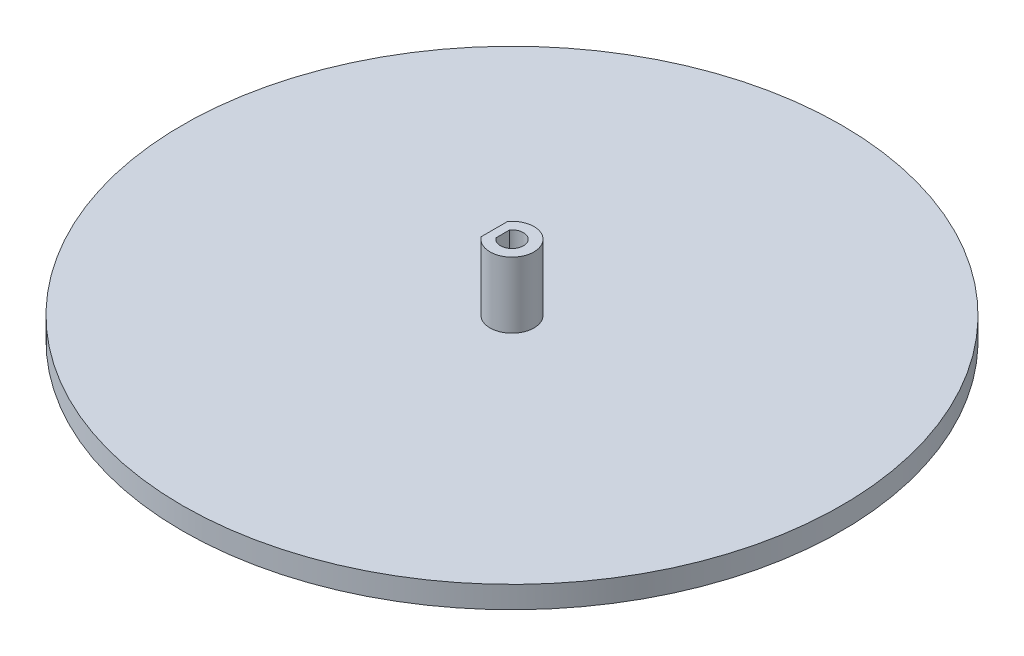
ISO-10303-21;
HEADER;
FILE_DESCRIPTION(('STEP AP214'),'2;1');
FILE_NAME('part.step','',(''),(''),'','','');
FILE_SCHEMA(('AUTOMOTIVE_DESIGN { 1 0 10303 214 1 1 1 1 }'));
ENDSEC;
DATA;
#1=APPLICATION_CONTEXT('core data for automotive mechanical design processes');
#2=APPLICATION_PROTOCOL_DEFINITION('international standard','automotive_design',2000,#1);
#3=PRODUCT_CONTEXT('',#1,'mechanical');
#4=PRODUCT('Part','Part','',(#3));
#5=PRODUCT_RELATED_PRODUCT_CATEGORY('part','',(#4));
#6=PRODUCT_DEFINITION_FORMATION('','',#4);
#7=PRODUCT_DEFINITION_CONTEXT('part definition',#1,'design');
#8=PRODUCT_DEFINITION('design','',#6,#7);
#9=PRODUCT_DEFINITION_SHAPE('','',#8);
#10=(LENGTH_UNIT() NAMED_UNIT(*) SI_UNIT(.MILLI.,.METRE.));
#11=(NAMED_UNIT(*) PLANE_ANGLE_UNIT() SI_UNIT($,.RADIAN.));
#12=(NAMED_UNIT(*) SI_UNIT($,.STERADIAN.) SOLID_ANGLE_UNIT());
#13=UNCERTAINTY_MEASURE_WITH_UNIT(LENGTH_MEASURE(1.E-05),#10,'distance_accuracy_value','');
#14=(GEOMETRIC_REPRESENTATION_CONTEXT(3) GLOBAL_UNCERTAINTY_ASSIGNED_CONTEXT((#13)) GLOBAL_UNIT_ASSIGNED_CONTEXT((#10,
#11,#12)) REPRESENTATION_CONTEXT('',''));
#15=CARTESIAN_POINT('',(0.,0.,0.));
#16=DIRECTION('',(0.,0.,1.));
#17=DIRECTION('',(1.,0.,0.));
#18=AXIS2_PLACEMENT_3D('',#15,#16,#17);
#19=CARTESIAN_POINT('',(0.,5.,0.));
#20=DIRECTION('',(0.,1.,0.));
#21=DIRECTION('',(0.,0.,1.));
#22=AXIS2_PLACEMENT_3D('',#19,#20,#21);
#23=PLANE('',#22);
#24=CARTESIAN_POINT('',(0.,5.,0.));
#25=DIRECTION('',(0.,1.,0.));
#26=DIRECTION('',(0.,0.,1.));
#27=AXIS2_PLACEMENT_3D('',#24,#25,#26);
#28=CIRCLE('',#27,75.);
#29=CARTESIAN_POINT('',(0.,5.,75.));
#30=VERTEX_POINT('',#29);
#31=EDGE_CURVE('E11',#30,#30,#28,.T.);
#32=ORIENTED_EDGE('',*,*,#31,.T.);
#33=EDGE_LOOP('',(#32));
#34=FACE_BOUND('',#33,.T.);
#35=DIRECTION('',(0.,0.,1.));
#36=VECTOR('',#35,1.);
#37=CARTESIAN_POINT('',(-4.,5.,-3.));
#38=LINE('',#37,#36);
#39=CARTESIAN_POINT('',(-4.,5.,-3.));
#40=VERTEX_POINT('',#39);
#41=CARTESIAN_POINT('',(-4.,5.,3.));
#42=VERTEX_POINT('',#41);
#43=EDGE_CURVE('E115',#40,#42,#38,.T.);
#44=ORIENTED_EDGE('',*,*,#43,.F.);
#45=CARTESIAN_POINT('',(0.,5.,0.));
#46=DIRECTION('',(0.,1.,0.));
#47=DIRECTION('',(0.,0.,1.));
#48=AXIS2_PLACEMENT_3D('',#45,#46,#47);
#49=CIRCLE('',#48,5.);
#50=EDGE_CURVE('E55',#42,#40,#49,.T.);
#51=ORIENTED_EDGE('',*,*,#50,.F.);
#52=EDGE_LOOP('',(#44,#51));
#53=FACE_BOUND('',#52,.T.);
#54=ADVANCED_FACE('F39',(#34,#53),#23,.T.);
#55=CARTESIAN_POINT('',(0.,5.,0.));
#56=DIRECTION('',(0.,-1.,0.));
#57=DIRECTION('',(0.,0.,-1.));
#58=AXIS2_PLACEMENT_3D('',#55,#56,#57);
#59=CYLINDRICAL_SURFACE('',#58,75.);
#60=ORIENTED_EDGE('',*,*,#31,.F.);
#61=EDGE_LOOP('',(#60));
#62=FACE_BOUND('',#61,.T.);
#63=CARTESIAN_POINT('',(0.,0.,0.));
#64=DIRECTION('',(0.,1.,0.));
#65=DIRECTION('',(0.,0.,1.));
#66=AXIS2_PLACEMENT_3D('',#63,#64,#65);
#67=CIRCLE('',#66,75.);
#68=CARTESIAN_POINT('',(0.,0.,75.));
#69=VERTEX_POINT('',#68);
#70=EDGE_CURVE('E43',#69,#69,#67,.T.);
#71=ORIENTED_EDGE('',*,*,#70,.T.);
#72=EDGE_LOOP('',(#71));
#73=FACE_BOUND('',#72,.T.);
#74=ADVANCED_FACE('F41',(#62,#73),#59,.T.);
#75=CARTESIAN_POINT('',(0.,0.,0.));
#76=DIRECTION('',(0.,1.,0.));
#77=DIRECTION('',(0.,0.,1.));
#78=AXIS2_PLACEMENT_3D('',#75,#76,#77);
#79=PLANE('',#78);
#80=ORIENTED_EDGE('',*,*,#70,.F.);
#81=EDGE_LOOP('',(#80));
#82=FACE_BOUND('',#81,.T.);
#83=ADVANCED_FACE('F134',(#82),#79,.F.);
#84=CARTESIAN_POINT('',(0.,20.,0.));
#85=DIRECTION('',(0.,1.,0.));
#86=DIRECTION('',(0.,0.,1.));
#87=AXIS2_PLACEMENT_3D('',#84,#85,#86);
#88=PLANE('',#87);
#89=CARTESIAN_POINT('',(0.,20.,0.));
#90=DIRECTION('',(0.,1.,0.));
#91=DIRECTION('',(0.,0.,1.));
#92=AXIS2_PLACEMENT_3D('',#89,#90,#91);
#93=CIRCLE('',#92,5.);
#94=CARTESIAN_POINT('',(-4.,20.,3.));
#95=VERTEX_POINT('',#94);
#96=CARTESIAN_POINT('',(-4.,20.,-3.));
#97=VERTEX_POINT('',#96);
#98=EDGE_CURVE('E110',#95,#97,#93,.T.);
#99=ORIENTED_EDGE('',*,*,#98,.T.);
#100=DIRECTION('',(0.,0.,1.));
#101=VECTOR('',#100,1.);
#102=CARTESIAN_POINT('',(-4.,20.,-3.));
#103=LINE('',#102,#101);
#104=EDGE_CURVE('E114',#97,#95,#103,.T.);
#105=ORIENTED_EDGE('',*,*,#104,.T.);
#106=EDGE_LOOP('',(#99,#105));
#107=FACE_BOUND('',#106,.T.);
#108=DIRECTION('',(0.,0.,1.));
#109=VECTOR('',#108,1.);
#110=CARTESIAN_POINT('',(-2.1,20.,-1.53297097167559));
#111=LINE('',#110,#109);
#112=CARTESIAN_POINT('',(-2.1,20.,-1.53297097167559));
#113=VERTEX_POINT('',#112);
#114=CARTESIAN_POINT('',(-2.1,20.,1.53297097167559));
#115=VERTEX_POINT('',#114);
#116=EDGE_CURVE('E83',#113,#115,#111,.T.);
#117=ORIENTED_EDGE('',*,*,#116,.F.);
#118=CARTESIAN_POINT('',(0.,20.,0.));
#119=DIRECTION('',(0.,1.,0.));
#120=DIRECTION('',(0.,0.,1.));
#121=AXIS2_PLACEMENT_3D('',#118,#119,#120);
#122=CIRCLE('',#121,2.6);
#123=EDGE_CURVE('E93',#115,#113,#122,.T.);
#124=ORIENTED_EDGE('',*,*,#123,.F.);
#125=EDGE_LOOP('',(#117,#124));
#126=FACE_BOUND('',#125,.T.);
#127=ADVANCED_FACE('F100',(#107,#126),#88,.T.);
#128=CARTESIAN_POINT('',(0.,20.,0.));
#129=DIRECTION('',(0.,-1.,0.));
#130=DIRECTION('',(0.,0.,-1.));
#131=AXIS2_PLACEMENT_3D('',#128,#129,#130);
#132=CYLINDRICAL_SURFACE('',#131,5.);
#133=ORIENTED_EDGE('',*,*,#50,.T.);
#134=DIRECTION('',(0.,-1.,0.));
#135=VECTOR('',#134,1.);
#136=CARTESIAN_POINT('',(-4.,20.,-3.));
#137=LINE('',#136,#135);
#138=EDGE_CURVE('E125',#97,#40,#137,.T.);
#139=ORIENTED_EDGE('',*,*,#138,.F.);
#140=ORIENTED_EDGE('',*,*,#98,.F.);
#141=DIRECTION('',(0.,-1.,0.));
#142=VECTOR('',#141,1.);
#143=CARTESIAN_POINT('',(-4.,20.,3.));
#144=LINE('',#143,#142);
#145=EDGE_CURVE('E118',#95,#42,#144,.T.);
#146=ORIENTED_EDGE('',*,*,#145,.T.);
#147=EDGE_LOOP('',(#133,#139,#140,#146));
#148=FACE_BOUND('',#147,.T.);
#149=ADVANCED_FACE('F141',(#148),#132,.T.);
#150=CARTESIAN_POINT('',(-4.,20.,-3.));
#151=DIRECTION('',(1.,0.,0.));
#152=DIRECTION('',(0.,0.,-1.));
#153=AXIS2_PLACEMENT_3D('',#150,#151,#152);
#154=PLANE('',#153);
#155=ORIENTED_EDGE('',*,*,#43,.T.);
#156=ORIENTED_EDGE('',*,*,#145,.F.);
#157=ORIENTED_EDGE('',*,*,#104,.F.);
#158=ORIENTED_EDGE('',*,*,#138,.T.);
#159=EDGE_LOOP('',(#155,#156,#157,#158));
#160=FACE_BOUND('',#159,.T.);
#161=ADVANCED_FACE('F161',(#160),#154,.F.);
#162=CARTESIAN_POINT('',(0.,20.,0.));
#163=DIRECTION('',(0.,-1.,0.));
#164=DIRECTION('',(0.,0.,-1.));
#165=AXIS2_PLACEMENT_3D('',#162,#163,#164);
#166=CYLINDRICAL_SURFACE('',#165,2.6);
#167=CARTESIAN_POINT('',(0.,5.,0.));
#168=DIRECTION('',(0.,1.,0.));
#169=DIRECTION('',(0.,0.,1.));
#170=AXIS2_PLACEMENT_3D('',#167,#168,#169);
#171=CIRCLE('',#170,2.6);
#172=CARTESIAN_POINT('',(-2.1,5.,1.53297097167559));
#173=VERTEX_POINT('',#172);
#174=CARTESIAN_POINT('',(-2.1,5.,-1.53297097167559));
#175=VERTEX_POINT('',#174);
#176=EDGE_CURVE('E97',#173,#175,#171,.T.);
#177=ORIENTED_EDGE('',*,*,#176,.F.);
#178=DIRECTION('',(0.,-1.,0.));
#179=VECTOR('',#178,1.);
#180=CARTESIAN_POINT('',(-2.1,20.,1.53297097167559));
#181=LINE('',#180,#179);
#182=EDGE_CURVE('E86',#115,#173,#181,.T.);
#183=ORIENTED_EDGE('',*,*,#182,.F.);
#184=ORIENTED_EDGE('',*,*,#123,.T.);
#185=DIRECTION('',(0.,-1.,0.));
#186=VECTOR('',#185,1.);
#187=CARTESIAN_POINT('',(-2.1,20.,-1.53297097167559));
#188=LINE('',#187,#186);
#189=EDGE_CURVE('E88',#113,#175,#188,.T.);
#190=ORIENTED_EDGE('',*,*,#189,.T.);
#191=EDGE_LOOP('',(#177,#183,#184,#190));
#192=FACE_BOUND('',#191,.T.);
#193=ADVANCED_FACE('F96',(#192),#166,.F.);
#194=CARTESIAN_POINT('',(-2.1,20.,-1.53297097167559));
#195=DIRECTION('',(1.,0.,0.));
#196=DIRECTION('',(0.,0.,-1.));
#197=AXIS2_PLACEMENT_3D('',#194,#195,#196);
#198=PLANE('',#197);
#199=DIRECTION('',(0.,0.,1.));
#200=VECTOR('',#199,1.);
#201=CARTESIAN_POINT('',(-2.1,5.,-1.53297097167559));
#202=LINE('',#201,#200);
#203=EDGE_CURVE('E62',#175,#173,#202,.T.);
#204=ORIENTED_EDGE('',*,*,#203,.F.);
#205=ORIENTED_EDGE('',*,*,#189,.F.);
#206=ORIENTED_EDGE('',*,*,#116,.T.);
#207=ORIENTED_EDGE('',*,*,#182,.T.);
#208=EDGE_LOOP('',(#204,#205,#206,#207));
#209=FACE_BOUND('',#208,.T.);
#210=ADVANCED_FACE('F85',(#209),#198,.T.);
#211=ORIENTED_EDGE('',*,*,#176,.T.);
#212=ORIENTED_EDGE('',*,*,#203,.T.);
#213=EDGE_LOOP('',(#211,#212));
#214=FACE_BOUND('',#213,.T.);
#215=ADVANCED_FACE('F149',(#214),#23,.T.);
#216=CLOSED_SHELL('',(#54,#74,#83,#127,#149,#161,#193,#210,#215));
#217=MANIFOLD_SOLID_BREP('B2',#216);
#218=ADVANCED_BREP_SHAPE_REPRESENTATION('',(#18,#217),#14);
#219=SHAPE_DEFINITION_REPRESENTATION(#9,#218);
ENDSEC;
END-ISO-10303-21;
